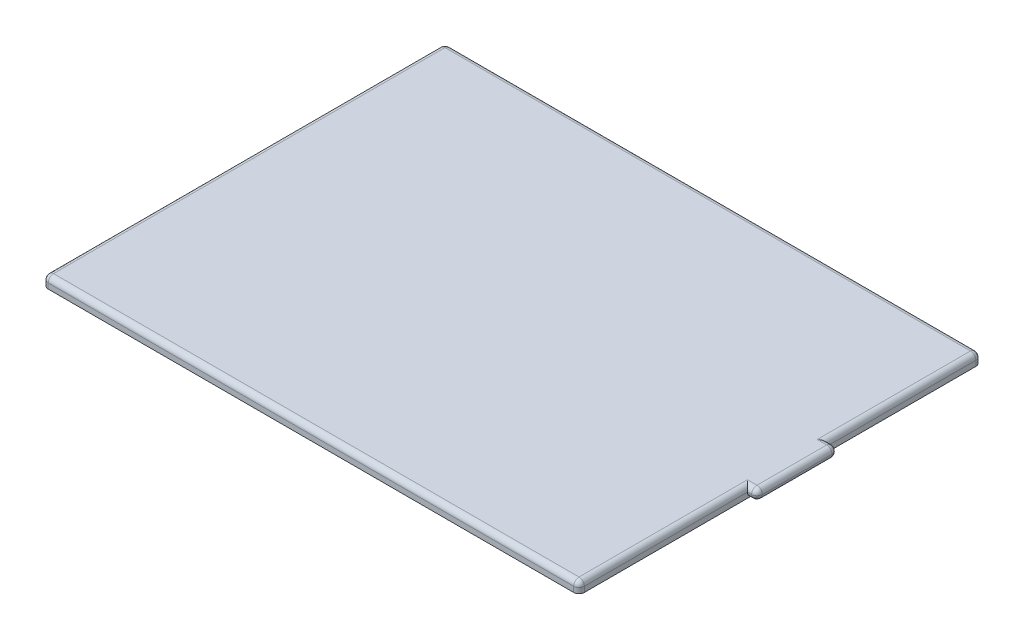
ISO-10303-21;
HEADER;
FILE_DESCRIPTION(('STEP AP214'),'2;1');
FILE_NAME('part.step','',(''),(''),'','','');
FILE_SCHEMA(('AUTOMOTIVE_DESIGN { 1 0 10303 214 1 1 1 1 }'));
ENDSEC;
DATA;
#1=APPLICATION_CONTEXT('core data for automotive mechanical design processes');
#2=APPLICATION_PROTOCOL_DEFINITION('international standard','automotive_design',2000,#1);
#3=PRODUCT_CONTEXT('',#1,'mechanical');
#4=PRODUCT('Part','Part','',(#3));
#5=PRODUCT_RELATED_PRODUCT_CATEGORY('part','',(#4));
#6=PRODUCT_DEFINITION_FORMATION('','',#4);
#7=PRODUCT_DEFINITION_CONTEXT('part definition',#1,'design');
#8=PRODUCT_DEFINITION('design','',#6,#7);
#9=PRODUCT_DEFINITION_SHAPE('','',#8);
#10=(LENGTH_UNIT() NAMED_UNIT(*) SI_UNIT(.MILLI.,.METRE.));
#11=(NAMED_UNIT(*) PLANE_ANGLE_UNIT() SI_UNIT($,.RADIAN.));
#12=(NAMED_UNIT(*) SI_UNIT($,.STERADIAN.) SOLID_ANGLE_UNIT());
#13=UNCERTAINTY_MEASURE_WITH_UNIT(LENGTH_MEASURE(1.E-05),#10,'distance_accuracy_value','');
#14=(GEOMETRIC_REPRESENTATION_CONTEXT(3) GLOBAL_UNCERTAINTY_ASSIGNED_CONTEXT((#13)) GLOBAL_UNIT_ASSIGNED_CONTEXT((#10,
#11,#12)) REPRESENTATION_CONTEXT('',''));
#15=CARTESIAN_POINT('',(0.,0.,0.));
#16=DIRECTION('',(0.,0.,1.));
#17=DIRECTION('',(1.,0.,0.));
#18=AXIS2_PLACEMENT_3D('',#15,#16,#17);
#19=CARTESIAN_POINT('',(-6.41025641025642,4.,-94.7115384615385));
#20=DIRECTION('',(-1.,0.,0.));
#21=DIRECTION('',(0.,0.,1.));
#22=AXIS2_PLACEMENT_3D('',#19,#20,#21);
#23=PLANE('',#22);
#24=DIRECTION('',(0.,0.,-1.));
#25=VECTOR('',#24,1.);
#26=CARTESIAN_POINT('',(-6.4102564102564,2.,53.2884615384615));
#27=LINE('',#26,#25);
#28=CARTESIAN_POINT('',(-6.41025641025642,2.,-92.7115384615385));
#29=VERTEX_POINT('',#28);
#30=CARTESIAN_POINT('',(-6.41025641025641,2.,-37.54913689604));
#31=VERTEX_POINT('',#30);
#32=EDGE_CURVE('E334',#29,#31,#27,.F.);
#33=ORIENTED_EDGE('',*,*,#32,.T.);
#34=CARTESIAN_POINT('',(-6.41025641025641,2.,-35.54913689604));
#35=DIRECTION('',(-1.,0.,0.));
#36=DIRECTION('',(0.,0.,1.));
#37=AXIS2_PLACEMENT_3D('',#34,#35,#36);
#38=CIRCLE('',#37,2.);
#39=CARTESIAN_POINT('',(-6.41025641025641,0.,-35.54913689604));
#40=VERTEX_POINT('',#39);
#41=EDGE_CURVE('E241',#31,#40,#38,.T.);
#42=ORIENTED_EDGE('',*,*,#41,.T.);
#43=DIRECTION('',(0.,0.,-1.));
#44=VECTOR('',#43,1.);
#45=CARTESIAN_POINT('',(-6.41025641025642,0.,-94.7115384615385));
#46=LINE('',#45,#44);
#47=CARTESIAN_POINT('',(-6.41025641025642,0.,-92.7115384615385));
#48=VERTEX_POINT('',#47);
#49=EDGE_CURVE('E291',#40,#48,#46,.T.);
#50=ORIENTED_EDGE('',*,*,#49,.T.);
#51=DIRECTION('',(0.,-1.,0.));
#52=VECTOR('',#51,1.);
#53=CARTESIAN_POINT('',(-6.41025641025642,4.,-92.7115384615385));
#54=LINE('',#53,#52);
#55=EDGE_CURVE('E336',#48,#29,#54,.F.);
#56=ORIENTED_EDGE('',*,*,#55,.T.);
#57=EDGE_LOOP('',(#33,#42,#50,#56));
#58=FACE_BOUND('',#57,.T.);
#59=ADVANCED_FACE('F35',(#58),#23,.F.);
#60=CARTESIAN_POINT('',(-8.41025641025641,2.,0.));
#61=DIRECTION('',(0.,0.,1.));
#62=DIRECTION('',(1.,0.,0.));
#63=AXIS2_PLACEMENT_3D('',#60,#61,#62);
#64=CYLINDRICAL_SURFACE('',#63,2.);
#65=DIRECTION('',(0.,0.,-1.));
#66=VECTOR('',#65,1.);
#67=CARTESIAN_POINT('',(-8.41025641025642,4.,-92.7115384615385));
#68=LINE('',#67,#66);
#69=CARTESIAN_POINT('',(-8.41025641025641,4.,-35.54913689604));
#70=VERTEX_POINT('',#69);
#71=CARTESIAN_POINT('',(-8.41025641025642,4.,-92.7115384615385));
#72=VERTEX_POINT('',#71);
#73=EDGE_CURVE('E360',#70,#72,#68,.T.);
#74=ORIENTED_EDGE('',*,*,#73,.F.);
#75=CARTESIAN_POINT('',(-8.41025641025641,2.,-35.54913689604));
#76=DIRECTION('',(-0.707106781186548,0.,-0.707106781186547));
#77=DIRECTION('',(-0.707106781186547,0.,0.707106781186548));
#78=AXIS2_PLACEMENT_3D('',#75,#76,#77);
#79=ELLIPSE('',#78,2.82842712474619,2.);
#80=EDGE_CURVE('E11',#70,#31,#79,.T.);
#81=ORIENTED_EDGE('',*,*,#80,.T.);
#82=ORIENTED_EDGE('',*,*,#32,.F.);
#83=CARTESIAN_POINT('',(-8.41025641025642,2.,-92.7115384615385));
#84=DIRECTION('',(0.,0.,1.));
#85=DIRECTION('',(1.,0.,0.));
#86=AXIS2_PLACEMENT_3D('',#83,#84,#85);
#87=CIRCLE('',#86,2.);
#88=EDGE_CURVE('E364',#29,#72,#87,.T.);
#89=ORIENTED_EDGE('',*,*,#88,.T.);
#90=EDGE_LOOP('',(#74,#81,#82,#89));
#91=FACE_BOUND('',#90,.T.);
#92=ADVANCED_FACE('F265',(#91),#64,.T.);
#93=CARTESIAN_POINT('',(-6.4102564102564,0.,53.2884615384615));
#94=VERTEX_POINT('',#93);
#95=CARTESIAN_POINT('',(-6.41025641025641,0.,-9.54913689603996));
#96=VERTEX_POINT('',#95);
#97=EDGE_CURVE('E286',#94,#96,#46,.T.);
#98=ORIENTED_EDGE('',*,*,#97,.T.);
#99=CARTESIAN_POINT('',(-6.41025641025641,2.,-9.54913689603996));
#100=DIRECTION('',(-1.,0.,0.));
#101=DIRECTION('',(0.,0.,1.));
#102=AXIS2_PLACEMENT_3D('',#99,#100,#101);
#103=CIRCLE('',#102,2.);
#104=CARTESIAN_POINT('',(-6.41025641025641,2.,-7.54913689603996));
#105=VERTEX_POINT('',#104);
#106=EDGE_CURVE('E85',#96,#105,#103,.T.);
#107=ORIENTED_EDGE('',*,*,#106,.T.);
#108=CARTESIAN_POINT('',(-6.4102564102564,2.,53.2884615384615));
#109=VERTEX_POINT('',#108);
#110=EDGE_CURVE('E249',#105,#109,#27,.F.);
#111=ORIENTED_EDGE('',*,*,#110,.T.);
#112=DIRECTION('',(0.,-1.,0.));
#113=VECTOR('',#112,1.);
#114=CARTESIAN_POINT('',(-6.4102564102564,4.,53.2884615384615));
#115=LINE('',#114,#113);
#116=EDGE_CURVE('E288',#109,#94,#115,.T.);
#117=ORIENTED_EDGE('',*,*,#116,.T.);
#118=EDGE_LOOP('',(#98,#107,#111,#117));
#119=FACE_BOUND('',#118,.T.);
#120=ADVANCED_FACE('F268',(#119),#23,.F.);
#121=CARTESIAN_POINT('',(-206.410256410256,4.,-94.7115384615385));
#122=DIRECTION('',(0.,0.,1.));
#123=DIRECTION('',(1.,0.,0.));
#124=AXIS2_PLACEMENT_3D('',#121,#122,#123);
#125=PLANE('',#124);
#126=DIRECTION('',(-1.,0.,0.));
#127=VECTOR('',#126,1.);
#128=CARTESIAN_POINT('',(-206.410256410256,0.,-94.7115384615385));
#129=LINE('',#128,#127);
#130=CARTESIAN_POINT('',(-8.41025641025642,0.,-94.7115384615385));
#131=VERTEX_POINT('',#130);
#132=CARTESIAN_POINT('',(-204.410256410256,0.,-94.7115384615385));
#133=VERTEX_POINT('',#132);
#134=EDGE_CURVE('E290',#131,#133,#129,.T.);
#135=ORIENTED_EDGE('',*,*,#134,.T.);
#136=DIRECTION('',(0.,-1.,0.));
#137=VECTOR('',#136,1.);
#138=CARTESIAN_POINT('',(-204.410256410256,4.,-94.7115384615385));
#139=LINE('',#138,#137);
#140=CARTESIAN_POINT('',(-204.410256410256,2.,-94.7115384615385));
#141=VERTEX_POINT('',#140);
#142=EDGE_CURVE('E374',#133,#141,#139,.F.);
#143=ORIENTED_EDGE('',*,*,#142,.T.);
#144=DIRECTION('',(-1.,0.,0.));
#145=VECTOR('',#144,1.);
#146=CARTESIAN_POINT('',(-6.41025641025642,2.,-94.7115384615385));
#147=LINE('',#146,#145);
#148=CARTESIAN_POINT('',(-8.41025641025642,2.,-94.7115384615385));
#149=VERTEX_POINT('',#148);
#150=EDGE_CURVE('E389',#141,#149,#147,.F.);
#151=ORIENTED_EDGE('',*,*,#150,.T.);
#152=DIRECTION('',(0.,-1.,0.));
#153=VECTOR('',#152,1.);
#154=CARTESIAN_POINT('',(-8.41025641025642,4.,-94.7115384615385));
#155=LINE('',#154,#153);
#156=EDGE_CURVE('E355',#149,#131,#155,.T.);
#157=ORIENTED_EDGE('',*,*,#156,.T.);
#158=EDGE_LOOP('',(#135,#143,#151,#157));
#159=FACE_BOUND('',#158,.T.);
#160=ADVANCED_FACE('F278',(#159),#125,.F.);
#161=CARTESIAN_POINT('',(-206.410256410256,4.,-94.7115384615385));
#162=DIRECTION('',(1.,0.,0.));
#163=DIRECTION('',(0.,0.,-1.));
#164=AXIS2_PLACEMENT_3D('',#161,#162,#163);
#165=PLANE('',#164);
#166=DIRECTION('',(0.,0.,1.));
#167=VECTOR('',#166,1.);
#168=CARTESIAN_POINT('',(-206.410256410256,2.,-94.7115384615385));
#169=LINE('',#168,#167);
#170=CARTESIAN_POINT('',(-206.410256410256,2.,53.2884615384615));
#171=VERTEX_POINT('',#170);
#172=CARTESIAN_POINT('',(-206.410256410256,2.,-92.7115384615385));
#173=VERTEX_POINT('',#172);
#174=EDGE_CURVE('E398',#171,#173,#169,.F.);
#175=ORIENTED_EDGE('',*,*,#174,.T.);
#176=DIRECTION('',(0.,-1.,0.));
#177=VECTOR('',#176,1.);
#178=CARTESIAN_POINT('',(-206.410256410256,4.,-92.7115384615385));
#179=LINE('',#178,#177);
#180=CARTESIAN_POINT('',(-206.410256410256,0.,-92.7115384615385));
#181=VERTEX_POINT('',#180);
#182=EDGE_CURVE('E361',#173,#181,#179,.T.);
#183=ORIENTED_EDGE('',*,*,#182,.T.);
#184=DIRECTION('',(0.,0.,1.));
#185=VECTOR('',#184,1.);
#186=CARTESIAN_POINT('',(-206.410256410256,0.,-94.7115384615385));
#187=LINE('',#186,#185);
#188=CARTESIAN_POINT('',(-206.410256410256,0.,53.2884615384615));
#189=VERTEX_POINT('',#188);
#190=EDGE_CURVE('E402',#181,#189,#187,.T.);
#191=ORIENTED_EDGE('',*,*,#190,.T.);
#192=DIRECTION('',(0.,-1.,0.));
#193=VECTOR('',#192,1.);
#194=CARTESIAN_POINT('',(-206.410256410256,4.,53.2884615384615));
#195=LINE('',#194,#193);
#196=EDGE_CURVE('E422',#189,#171,#195,.F.);
#197=ORIENTED_EDGE('',*,*,#196,.T.);
#198=EDGE_LOOP('',(#175,#183,#191,#197));
#199=FACE_BOUND('',#198,.T.);
#200=ADVANCED_FACE('F282',(#199),#165,.F.);
#201=CARTESIAN_POINT('',(-206.410256410256,4.,55.2884615384615));
#202=DIRECTION('',(0.,0.,-1.));
#203=DIRECTION('',(-1.,0.,0.));
#204=AXIS2_PLACEMENT_3D('',#201,#202,#203);
#205=PLANE('',#204);
#206=DIRECTION('',(1.,0.,0.));
#207=VECTOR('',#206,1.);
#208=CARTESIAN_POINT('',(-206.410256410256,0.,55.2884615384615));
#209=LINE('',#208,#207);
#210=CARTESIAN_POINT('',(-204.410256410256,0.,55.2884615384615));
#211=VERTEX_POINT('',#210);
#212=CARTESIAN_POINT('',(-8.41025641025639,0.,55.2884615384615));
#213=VERTEX_POINT('',#212);
#214=EDGE_CURVE('E393',#211,#213,#209,.T.);
#215=ORIENTED_EDGE('',*,*,#214,.T.);
#216=DIRECTION('',(0.,-1.,0.));
#217=VECTOR('',#216,1.);
#218=CARTESIAN_POINT('',(-8.41025641025639,4.,55.2884615384615));
#219=LINE('',#218,#217);
#220=CARTESIAN_POINT('',(-8.41025641025639,2.,55.2884615384615));
#221=VERTEX_POINT('',#220);
#222=EDGE_CURVE('E351',#213,#221,#219,.F.);
#223=ORIENTED_EDGE('',*,*,#222,.T.);
#224=DIRECTION('',(1.,0.,0.));
#225=VECTOR('',#224,1.);
#226=CARTESIAN_POINT('',(-204.410256410256,2.,55.2884615384615));
#227=LINE('',#226,#225);
#228=CARTESIAN_POINT('',(-204.410256410256,2.,55.2884615384615));
#229=VERTEX_POINT('',#228);
#230=EDGE_CURVE('E416',#221,#229,#227,.F.);
#231=ORIENTED_EDGE('',*,*,#230,.T.);
#232=DIRECTION('',(0.,-1.,0.));
#233=VECTOR('',#232,1.);
#234=CARTESIAN_POINT('',(-204.410256410256,4.,55.2884615384615));
#235=LINE('',#234,#233);
#236=EDGE_CURVE('E418',#229,#211,#235,.T.);
#237=ORIENTED_EDGE('',*,*,#236,.T.);
#238=EDGE_LOOP('',(#215,#223,#231,#237));
#239=FACE_BOUND('',#238,.T.);
#240=ADVANCED_FACE('F443',(#239),#205,.F.);
#241=CARTESIAN_POINT('',(0.,4.,0.));
#242=DIRECTION('',(0.,1.,0.));
#243=DIRECTION('',(0.,0.,1.));
#244=AXIS2_PLACEMENT_3D('',#241,#242,#243);
#245=PLANE('',#244);
#246=CARTESIAN_POINT('',(-8.4102564102564,4.,53.2884615384615));
#247=VERTEX_POINT('',#246);
#248=CARTESIAN_POINT('',(-8.41025641025641,4.,-9.54913689603996));
#249=VERTEX_POINT('',#248);
#250=EDGE_CURVE('E54',#247,#249,#68,.T.);
#251=ORIENTED_EDGE('',*,*,#250,.T.);
#252=DIRECTION('',(1.,0.,0.));
#253=VECTOR('',#252,1.);
#254=CARTESIAN_POINT('',(0.,4.,-9.54913689603996));
#255=LINE('',#254,#253);
#256=CARTESIAN_POINT('',(-4.86589045098342,4.,-9.54913689603996));
#257=VERTEX_POINT('',#256);
#258=EDGE_CURVE('E169',#249,#257,#255,.T.);
#259=ORIENTED_EDGE('',*,*,#258,.T.);
#260=DIRECTION('',(0.,0.,-1.));
#261=VECTOR('',#260,1.);
#262=CARTESIAN_POINT('',(-4.86589045098341,4.,0.));
#263=LINE('',#262,#261);
#264=CARTESIAN_POINT('',(-4.86589045098342,4.,-35.54913689604));
#265=VERTEX_POINT('',#264);
#266=EDGE_CURVE('E163',#257,#265,#263,.T.);
#267=ORIENTED_EDGE('',*,*,#266,.T.);
#268=DIRECTION('',(-1.,0.,0.));
#269=VECTOR('',#268,1.);
#270=CARTESIAN_POINT('',(0.,4.,-35.54913689604));
#271=LINE('',#270,#269);
#272=EDGE_CURVE('E166',#265,#70,#271,.T.);
#273=ORIENTED_EDGE('',*,*,#272,.T.);
#274=ORIENTED_EDGE('',*,*,#73,.T.);
#275=DIRECTION('',(-1.,0.,0.));
#276=VECTOR('',#275,1.);
#277=CARTESIAN_POINT('',(-206.410256410256,4.,-92.7115384615385));
#278=LINE('',#277,#276);
#279=CARTESIAN_POINT('',(-204.410256410256,4.,-92.7115384615385));
#280=VERTEX_POINT('',#279);
#281=EDGE_CURVE('E387',#72,#280,#278,.T.);
#282=ORIENTED_EDGE('',*,*,#281,.T.);
#283=DIRECTION('',(0.,0.,1.));
#284=VECTOR('',#283,1.);
#285=CARTESIAN_POINT('',(-204.410256410256,4.,55.2884615384615));
#286=LINE('',#285,#284);
#287=CARTESIAN_POINT('',(-204.410256410256,4.,53.2884615384615));
#288=VERTEX_POINT('',#287);
#289=EDGE_CURVE('E391',#280,#288,#286,.T.);
#290=ORIENTED_EDGE('',*,*,#289,.T.);
#291=DIRECTION('',(1.,0.,0.));
#292=VECTOR('',#291,1.);
#293=CARTESIAN_POINT('',(-6.4102564102564,4.,53.2884615384615));
#294=LINE('',#293,#292);
#295=EDGE_CURVE('E341',#288,#247,#294,.T.);
#296=ORIENTED_EDGE('',*,*,#295,.T.);
#297=EDGE_LOOP('',(#251,#259,#267,#273,#274,#282,#290,#296));
#298=FACE_BOUND('',#297,.T.);
#299=ADVANCED_FACE('F165',(#298),#245,.T.);
#300=CARTESIAN_POINT('',(0.,0.,0.));
#301=DIRECTION('',(0.,1.,0.));
#302=DIRECTION('',(0.,0.,1.));
#303=AXIS2_PLACEMENT_3D('',#300,#301,#302);
#304=PLANE('',#303);
#305=DIRECTION('',(1.,0.,0.));
#306=VECTOR('',#305,1.);
#307=CARTESIAN_POINT('',(-6.4102564102564,0.,-9.54913689603996));
#308=LINE('',#307,#306);
#309=CARTESIAN_POINT('',(-4.86589045098342,0.,-9.54913689603996));
#310=VERTEX_POINT('',#309);
#311=EDGE_CURVE('E235',#310,#96,#308,.F.);
#312=ORIENTED_EDGE('',*,*,#311,.T.);
#313=ORIENTED_EDGE('',*,*,#97,.F.);
#314=CARTESIAN_POINT('',(-8.4102564102564,0.,53.2884615384615));
#315=DIRECTION('',(0.,1.,0.));
#316=DIRECTION('',(0.,0.,1.));
#317=AXIS2_PLACEMENT_3D('',#314,#315,#316);
#318=CIRCLE('',#317,2.);
#319=EDGE_CURVE('E349',#94,#213,#318,.F.);
#320=ORIENTED_EDGE('',*,*,#319,.T.);
#321=ORIENTED_EDGE('',*,*,#214,.F.);
#322=CARTESIAN_POINT('',(-204.410256410256,0.,53.2884615384615));
#323=DIRECTION('',(0.,1.,0.));
#324=DIRECTION('',(0.,0.,1.));
#325=AXIS2_PLACEMENT_3D('',#322,#323,#324);
#326=CIRCLE('',#325,2.);
#327=EDGE_CURVE('E407',#211,#189,#326,.F.);
#328=ORIENTED_EDGE('',*,*,#327,.T.);
#329=ORIENTED_EDGE('',*,*,#190,.F.);
#330=CARTESIAN_POINT('',(-204.410256410256,0.,-92.7115384615385));
#331=DIRECTION('',(0.,1.,0.));
#332=DIRECTION('',(0.,0.,1.));
#333=AXIS2_PLACEMENT_3D('',#330,#331,#332);
#334=CIRCLE('',#333,2.);
#335=EDGE_CURVE('E372',#181,#133,#334,.F.);
#336=ORIENTED_EDGE('',*,*,#335,.T.);
#337=ORIENTED_EDGE('',*,*,#134,.F.);
#338=CARTESIAN_POINT('',(-8.41025641025642,0.,-92.7115384615385));
#339=DIRECTION('',(0.,1.,0.));
#340=DIRECTION('',(0.,0.,1.));
#341=AXIS2_PLACEMENT_3D('',#338,#339,#340);
#342=CIRCLE('',#341,2.);
#343=EDGE_CURVE('E347',#131,#48,#342,.F.);
#344=ORIENTED_EDGE('',*,*,#343,.T.);
#345=ORIENTED_EDGE('',*,*,#49,.F.);
#346=DIRECTION('',(-1.,0.,0.));
#347=VECTOR('',#346,1.);
#348=CARTESIAN_POINT('',(-2.86589045098342,0.,-35.54913689604));
#349=LINE('',#348,#347);
#350=CARTESIAN_POINT('',(-4.86589045098342,0.,-35.54913689604));
#351=VERTEX_POINT('',#350);
#352=EDGE_CURVE('E174',#40,#351,#349,.F.);
#353=ORIENTED_EDGE('',*,*,#352,.T.);
#354=DIRECTION('',(0.,0.,-1.));
#355=VECTOR('',#354,1.);
#356=CARTESIAN_POINT('',(-4.86589045098342,0.,-7.54913689603996));
#357=LINE('',#356,#355);
#358=EDGE_CURVE('E233',#351,#310,#357,.F.);
#359=ORIENTED_EDGE('',*,*,#358,.T.);
#360=EDGE_LOOP('',(#312,#313,#320,#321,#328,#329,#336,#337,#344,#345,#353,#359));
#361=FACE_BOUND('',#360,.T.);
#362=ADVANCED_FACE('F294',(#361),#304,.F.);
#363=CARTESIAN_POINT('',(0.,2.,-92.7115384615385));
#364=DIRECTION('',(1.,0.,0.));
#365=DIRECTION('',(0.,0.,-1.));
#366=AXIS2_PLACEMENT_3D('',#363,#364,#365);
#367=CYLINDRICAL_SURFACE('',#366,2.);
#368=ORIENTED_EDGE('',*,*,#150,.F.);
#369=CARTESIAN_POINT('',(-204.410256410256,2.,-92.7115384615385));
#370=DIRECTION('',(1.,0.,0.));
#371=DIRECTION('',(0.,0.,-1.));
#372=AXIS2_PLACEMENT_3D('',#369,#370,#371);
#373=CIRCLE('',#372,2.);
#374=EDGE_CURVE('E231',#141,#280,#373,.T.);
#375=ORIENTED_EDGE('',*,*,#374,.T.);
#376=ORIENTED_EDGE('',*,*,#281,.F.);
#377=CARTESIAN_POINT('',(-8.41025641025642,2.,-92.7115384615385));
#378=DIRECTION('',(1.,0.,0.));
#379=DIRECTION('',(0.,0.,-1.));
#380=AXIS2_PLACEMENT_3D('',#377,#378,#379);
#381=CIRCLE('',#380,2.);
#382=EDGE_CURVE('E357',#72,#149,#381,.F.);
#383=ORIENTED_EDGE('',*,*,#382,.T.);
#384=EDGE_LOOP('',(#368,#375,#376,#383));
#385=FACE_BOUND('',#384,.T.);
#386=ADVANCED_FACE('F386',(#385),#367,.T.);
#387=CARTESIAN_POINT('',(-204.410256410256,2.,0.));
#388=DIRECTION('',(0.,0.,-1.));
#389=DIRECTION('',(-1.,0.,0.));
#390=AXIS2_PLACEMENT_3D('',#387,#388,#389);
#391=CYLINDRICAL_SURFACE('',#390,2.);
#392=ORIENTED_EDGE('',*,*,#289,.F.);
#393=CARTESIAN_POINT('',(-204.410256410256,2.,-92.7115384615385));
#394=DIRECTION('',(0.,0.,-1.));
#395=DIRECTION('',(-1.,0.,0.));
#396=AXIS2_PLACEMENT_3D('',#393,#394,#395);
#397=CIRCLE('',#396,2.);
#398=EDGE_CURVE('E375',#280,#173,#397,.F.);
#399=ORIENTED_EDGE('',*,*,#398,.T.);
#400=ORIENTED_EDGE('',*,*,#174,.F.);
#401=CARTESIAN_POINT('',(-204.410256410256,2.,53.2884615384615));
#402=DIRECTION('',(0.,0.,-1.));
#403=DIRECTION('',(-1.,0.,0.));
#404=AXIS2_PLACEMENT_3D('',#401,#402,#403);
#405=CIRCLE('',#404,2.);
#406=EDGE_CURVE('E397',#171,#288,#405,.T.);
#407=ORIENTED_EDGE('',*,*,#406,.T.);
#408=EDGE_LOOP('',(#392,#399,#400,#407));
#409=FACE_BOUND('',#408,.T.);
#410=ADVANCED_FACE('F395',(#409),#391,.T.);
#411=CARTESIAN_POINT('',(0.,2.,53.2884615384615));
#412=DIRECTION('',(-1.,0.,0.));
#413=DIRECTION('',(0.,0.,1.));
#414=AXIS2_PLACEMENT_3D('',#411,#412,#413);
#415=CYLINDRICAL_SURFACE('',#414,2.);
#416=ORIENTED_EDGE('',*,*,#230,.F.);
#417=CARTESIAN_POINT('',(-8.4102564102564,2.,53.2884615384615));
#418=DIRECTION('',(-1.,0.,0.));
#419=DIRECTION('',(0.,0.,1.));
#420=AXIS2_PLACEMENT_3D('',#417,#418,#419);
#421=CIRCLE('',#420,2.);
#422=EDGE_CURVE('E353',#221,#247,#421,.T.);
#423=ORIENTED_EDGE('',*,*,#422,.T.);
#424=ORIENTED_EDGE('',*,*,#295,.F.);
#425=CARTESIAN_POINT('',(-204.410256410256,2.,53.2884615384615));
#426=DIRECTION('',(-1.,0.,0.));
#427=DIRECTION('',(0.,0.,1.));
#428=AXIS2_PLACEMENT_3D('',#425,#426,#427);
#429=CIRCLE('',#428,2.);
#430=EDGE_CURVE('E343',#229,#288,#429,.T.);
#431=ORIENTED_EDGE('',*,*,#430,.F.);
#432=EDGE_LOOP('',(#416,#423,#424,#431));
#433=FACE_BOUND('',#432,.T.);
#434=ADVANCED_FACE('F435',(#433),#415,.T.);
#435=CARTESIAN_POINT('',(-204.410256410256,2.,53.2884615384615));
#436=DIRECTION('',(0.,0.,-1.));
#437=DIRECTION('',(-1.,0.,0.));
#438=AXIS2_PLACEMENT_3D('',#435,#436,#437);
#439=SPHERICAL_SURFACE('',#438,2.);
#440=ORIENTED_EDGE('',*,*,#430,.T.);
#441=ORIENTED_EDGE('',*,*,#406,.F.);
#442=CARTESIAN_POINT('',(-204.410256410256,2.,53.2884615384615));
#443=DIRECTION('',(0.,-1.,0.));
#444=DIRECTION('',(0.,0.,-1.));
#445=AXIS2_PLACEMENT_3D('',#442,#443,#444);
#446=CIRCLE('',#445,2.);
#447=EDGE_CURVE('E369',#229,#171,#446,.T.);
#448=ORIENTED_EDGE('',*,*,#447,.F.);
#449=EDGE_LOOP('',(#440,#441,#448));
#450=FACE_BOUND('',#449,.T.);
#451=ADVANCED_FACE('F432',(#450),#439,.T.);
#452=CARTESIAN_POINT('',(-204.410256410256,4.,53.2884615384615));
#453=DIRECTION('',(0.,-1.,0.));
#454=DIRECTION('',(0.,0.,-1.));
#455=AXIS2_PLACEMENT_3D('',#452,#453,#454);
#456=CYLINDRICAL_SURFACE('',#455,2.);
#457=ORIENTED_EDGE('',*,*,#447,.T.);
#458=ORIENTED_EDGE('',*,*,#196,.F.);
#459=ORIENTED_EDGE('',*,*,#327,.F.);
#460=ORIENTED_EDGE('',*,*,#236,.F.);
#461=EDGE_LOOP('',(#457,#458,#459,#460));
#462=FACE_BOUND('',#461,.T.);
#463=ADVANCED_FACE('F444',(#462),#456,.T.);
#464=CARTESIAN_POINT('',(-8.41025641025642,4.,-92.7115384615385));
#465=DIRECTION('',(0.,-1.,0.));
#466=DIRECTION('',(0.,0.,-1.));
#467=AXIS2_PLACEMENT_3D('',#464,#465,#466);
#468=CYLINDRICAL_SURFACE('',#467,2.);
#469=ORIENTED_EDGE('',*,*,#343,.F.);
#470=ORIENTED_EDGE('',*,*,#156,.F.);
#471=CARTESIAN_POINT('',(-8.41025641025642,2.,-92.7115384615385));
#472=DIRECTION('',(0.,1.,0.));
#473=DIRECTION('',(0.,0.,1.));
#474=AXIS2_PLACEMENT_3D('',#471,#472,#473);
#475=CIRCLE('',#474,2.);
#476=EDGE_CURVE('E366',#29,#149,#475,.T.);
#477=ORIENTED_EDGE('',*,*,#476,.F.);
#478=ORIENTED_EDGE('',*,*,#55,.F.);
#479=EDGE_LOOP('',(#469,#470,#477,#478));
#480=FACE_BOUND('',#479,.T.);
#481=ADVANCED_FACE('F312',(#480),#468,.T.);
#482=CARTESIAN_POINT('',(-8.41025641025642,2.,-92.7115384615385));
#483=DIRECTION('',(-1.,0.,0.));
#484=DIRECTION('',(0.,0.,1.));
#485=AXIS2_PLACEMENT_3D('',#482,#483,#484);
#486=SPHERICAL_SURFACE('',#485,2.);
#487=ORIENTED_EDGE('',*,*,#476,.T.);
#488=ORIENTED_EDGE('',*,*,#382,.F.);
#489=ORIENTED_EDGE('',*,*,#88,.F.);
#490=EDGE_LOOP('',(#487,#488,#489));
#491=FACE_BOUND('',#490,.T.);
#492=ADVANCED_FACE('F451',(#491),#486,.T.);
#493=ORIENTED_EDGE('',*,*,#110,.F.);
#494=CARTESIAN_POINT('',(-8.41025641025641,2.,-9.54913689603996));
#495=DIRECTION('',(0.707106781186547,0.,-0.707106781186548));
#496=DIRECTION('',(0.707106781186548,0.,0.707106781186547));
#497=AXIS2_PLACEMENT_3D('',#494,#495,#496);
#498=ELLIPSE('',#497,2.82842712474619,2.);
#499=EDGE_CURVE('E45',#105,#249,#498,.F.);
#500=ORIENTED_EDGE('',*,*,#499,.T.);
#501=ORIENTED_EDGE('',*,*,#250,.F.);
#502=CARTESIAN_POINT('',(-8.4102564102564,2.,53.2884615384615));
#503=DIRECTION('',(0.,0.,1.));
#504=DIRECTION('',(1.,0.,0.));
#505=AXIS2_PLACEMENT_3D('',#502,#503,#504);
#506=CIRCLE('',#505,2.);
#507=EDGE_CURVE('E227',#109,#247,#506,.T.);
#508=ORIENTED_EDGE('',*,*,#507,.F.);
#509=EDGE_LOOP('',(#493,#500,#501,#508));
#510=FACE_BOUND('',#509,.T.);
#511=ADVANCED_FACE('F246',(#510),#64,.T.);
#512=CARTESIAN_POINT('',(-8.4102564102564,2.,53.2884615384615));
#513=DIRECTION('',(-1.,0.,0.));
#514=DIRECTION('',(0.,0.,1.));
#515=AXIS2_PLACEMENT_3D('',#512,#513,#514);
#516=SPHERICAL_SURFACE('',#515,2.);
#517=ORIENTED_EDGE('',*,*,#507,.T.);
#518=ORIENTED_EDGE('',*,*,#422,.F.);
#519=CARTESIAN_POINT('',(-8.4102564102564,2.,53.2884615384615));
#520=DIRECTION('',(0.,-1.,0.));
#521=DIRECTION('',(0.,0.,-1.));
#522=AXIS2_PLACEMENT_3D('',#519,#520,#521);
#523=CIRCLE('',#522,2.);
#524=EDGE_CURVE('E220',#109,#221,#523,.T.);
#525=ORIENTED_EDGE('',*,*,#524,.F.);
#526=EDGE_LOOP('',(#517,#518,#525));
#527=FACE_BOUND('',#526,.T.);
#528=ADVANCED_FACE('F439',(#527),#516,.T.);
#529=CARTESIAN_POINT('',(-8.4102564102564,4.,53.2884615384615));
#530=DIRECTION('',(0.,-1.,0.));
#531=DIRECTION('',(0.,0.,-1.));
#532=AXIS2_PLACEMENT_3D('',#529,#530,#531);
#533=CYLINDRICAL_SURFACE('',#532,2.);
#534=ORIENTED_EDGE('',*,*,#524,.T.);
#535=ORIENTED_EDGE('',*,*,#222,.F.);
#536=ORIENTED_EDGE('',*,*,#319,.F.);
#537=ORIENTED_EDGE('',*,*,#116,.F.);
#538=EDGE_LOOP('',(#534,#535,#536,#537));
#539=FACE_BOUND('',#538,.T.);
#540=ADVANCED_FACE('F308',(#539),#533,.T.);
#541=CARTESIAN_POINT('',(-204.410256410256,2.,-92.7115384615385));
#542=DIRECTION('',(0.,0.,1.));
#543=DIRECTION('',(1.,0.,0.));
#544=AXIS2_PLACEMENT_3D('',#541,#542,#543);
#545=SPHERICAL_SURFACE('',#544,2.);
#546=ORIENTED_EDGE('',*,*,#398,.F.);
#547=ORIENTED_EDGE('',*,*,#374,.F.);
#548=CARTESIAN_POINT('',(-204.410256410256,2.,-92.7115384615385));
#549=DIRECTION('',(0.,-1.,0.));
#550=DIRECTION('',(0.,0.,-1.));
#551=AXIS2_PLACEMENT_3D('',#548,#549,#550);
#552=CIRCLE('',#551,2.);
#553=EDGE_CURVE('E215',#173,#141,#552,.T.);
#554=ORIENTED_EDGE('',*,*,#553,.F.);
#555=EDGE_LOOP('',(#546,#547,#554));
#556=FACE_BOUND('',#555,.T.);
#557=ADVANCED_FACE('F303',(#556),#545,.T.);
#558=CARTESIAN_POINT('',(-204.410256410256,4.,-92.7115384615385));
#559=DIRECTION('',(0.,-1.,0.));
#560=DIRECTION('',(0.,0.,-1.));
#561=AXIS2_PLACEMENT_3D('',#558,#559,#560);
#562=CYLINDRICAL_SURFACE('',#561,2.);
#563=ORIENTED_EDGE('',*,*,#553,.T.);
#564=ORIENTED_EDGE('',*,*,#142,.F.);
#565=ORIENTED_EDGE('',*,*,#335,.F.);
#566=ORIENTED_EDGE('',*,*,#182,.F.);
#567=EDGE_LOOP('',(#563,#564,#565,#566));
#568=FACE_BOUND('',#567,.T.);
#569=ADVANCED_FACE('F298',(#568),#562,.T.);
#570=CARTESIAN_POINT('',(-10.8658904509834,2.,-9.54913689603996));
#571=DIRECTION('',(-1.,0.,0.));
#572=DIRECTION('',(0.,0.,1.));
#573=AXIS2_PLACEMENT_3D('',#570,#571,#572);
#574=CYLINDRICAL_SURFACE('',#573,2.);
#575=CARTESIAN_POINT('',(-4.86589045098342,2.,-9.54913689603996));
#576=DIRECTION('',(1.,0.,0.));
#577=DIRECTION('',(0.,0.,-1.));
#578=AXIS2_PLACEMENT_3D('',#575,#576,#577);
#579=CIRCLE('',#578,2.);
#580=CARTESIAN_POINT('',(-4.86589045098342,2.,-7.54913689603996));
#581=VERTEX_POINT('',#580);
#582=EDGE_CURVE('E213',#581,#310,#579,.T.);
#583=ORIENTED_EDGE('',*,*,#582,.F.);
#584=DIRECTION('',(1.,0.,0.));
#585=VECTOR('',#584,1.);
#586=CARTESIAN_POINT('',(-2.86589045098341,2.,-7.54913689603996));
#587=LINE('',#586,#585);
#588=EDGE_CURVE('E39',#105,#581,#587,.T.);
#589=ORIENTED_EDGE('',*,*,#588,.F.);
#590=ORIENTED_EDGE('',*,*,#106,.F.);
#591=ORIENTED_EDGE('',*,*,#311,.F.);
#592=EDGE_LOOP('',(#583,#589,#590,#591));
#593=FACE_BOUND('',#592,.T.);
#594=ADVANCED_FACE('F37',(#593),#574,.T.);
#595=CARTESIAN_POINT('',(0.,2.,-9.54913689603996));
#596=DIRECTION('',(1.,0.,0.));
#597=DIRECTION('',(0.,0.,-1.));
#598=AXIS2_PLACEMENT_3D('',#595,#596,#597);
#599=CYLINDRICAL_SURFACE('',#598,2.);
#600=ORIENTED_EDGE('',*,*,#499,.F.);
#601=ORIENTED_EDGE('',*,*,#588,.T.);
#602=CARTESIAN_POINT('',(-4.86589045098342,2.,-9.54913689603996));
#603=DIRECTION('',(1.,0.,0.));
#604=DIRECTION('',(0.,0.,-1.));
#605=AXIS2_PLACEMENT_3D('',#602,#603,#604);
#606=CIRCLE('',#605,2.);
#607=EDGE_CURVE('E211',#257,#581,#606,.T.);
#608=ORIENTED_EDGE('',*,*,#607,.F.);
#609=ORIENTED_EDGE('',*,*,#258,.F.);
#610=EDGE_LOOP('',(#600,#601,#608,#609));
#611=FACE_BOUND('',#610,.T.);
#612=ADVANCED_FACE('F250',(#611),#599,.T.);
#613=CARTESIAN_POINT('',(-4.86589045098342,2.,-9.54913689603996));
#614=DIRECTION('',(0.,0.,1.));
#615=DIRECTION('',(1.,0.,0.));
#616=AXIS2_PLACEMENT_3D('',#613,#614,#615);
#617=SPHERICAL_SURFACE('',#616,2.);
#618=CARTESIAN_POINT('',(-4.86589045098342,2.,-9.54913689603996));
#619=DIRECTION('',(0.,-1.,0.));
#620=DIRECTION('',(0.,0.,-1.));
#621=AXIS2_PLACEMENT_3D('',#618,#619,#620);
#622=CIRCLE('',#621,2.);
#623=CARTESIAN_POINT('',(-2.86589045098342,2.,-9.54913689603996));
#624=VERTEX_POINT('',#623);
#625=EDGE_CURVE('E72',#624,#581,#622,.T.);
#626=ORIENTED_EDGE('',*,*,#625,.T.);
#627=ORIENTED_EDGE('',*,*,#582,.T.);
#628=CARTESIAN_POINT('',(-4.86589045098342,2.,-9.54913689603996));
#629=DIRECTION('',(0.,0.,1.));
#630=DIRECTION('',(1.,0.,0.));
#631=AXIS2_PLACEMENT_3D('',#628,#629,#630);
#632=CIRCLE('',#631,2.);
#633=EDGE_CURVE('E208',#624,#310,#632,.F.);
#634=ORIENTED_EDGE('',*,*,#633,.F.);
#635=EDGE_LOOP('',(#626,#627,#634));
#636=FACE_BOUND('',#635,.T.);
#637=ADVANCED_FACE('F254',(#636),#617,.T.);
#638=CARTESIAN_POINT('',(-4.86589045098342,2.,-9.54913689603996));
#639=DIRECTION('',(0.,0.,1.));
#640=DIRECTION('',(1.,0.,0.));
#641=AXIS2_PLACEMENT_3D('',#638,#639,#640);
#642=SPHERICAL_SURFACE('',#641,2.);
#643=ORIENTED_EDGE('',*,*,#607,.T.);
#644=ORIENTED_EDGE('',*,*,#625,.F.);
#645=CARTESIAN_POINT('',(-4.86589045098342,2.,-9.54913689603996));
#646=DIRECTION('',(0.,0.,1.));
#647=DIRECTION('',(1.,0.,0.));
#648=AXIS2_PLACEMENT_3D('',#645,#646,#647);
#649=CIRCLE('',#648,2.);
#650=EDGE_CURVE('E205',#257,#624,#649,.F.);
#651=ORIENTED_EDGE('',*,*,#650,.F.);
#652=EDGE_LOOP('',(#643,#644,#651));
#653=FACE_BOUND('',#652,.T.);
#654=ADVANCED_FACE('F251',(#653),#642,.T.);
#655=CARTESIAN_POINT('',(-10.8658904509834,2.,-35.54913689604));
#656=DIRECTION('',(1.,0.,0.));
#657=DIRECTION('',(0.,0.,-1.));
#658=AXIS2_PLACEMENT_3D('',#655,#656,#657);
#659=CYLINDRICAL_SURFACE('',#658,2.);
#660=ORIENTED_EDGE('',*,*,#352,.F.);
#661=ORIENTED_EDGE('',*,*,#41,.F.);
#662=DIRECTION('',(-1.,0.,0.));
#663=VECTOR('',#662,1.);
#664=CARTESIAN_POINT('',(-6.4102564102564,2.,-37.54913689604));
#665=LINE('',#664,#663);
#666=CARTESIAN_POINT('',(-4.86589045098342,2.,-37.54913689604));
#667=VERTEX_POINT('',#666);
#668=EDGE_CURVE('E203',#667,#31,#665,.T.);
#669=ORIENTED_EDGE('',*,*,#668,.F.);
#670=CARTESIAN_POINT('',(-4.86589045098342,2.,-35.54913689604));
#671=DIRECTION('',(1.,0.,0.));
#672=DIRECTION('',(0.,0.,-1.));
#673=AXIS2_PLACEMENT_3D('',#670,#671,#672);
#674=CIRCLE('',#673,2.);
#675=EDGE_CURVE('E200',#351,#667,#674,.T.);
#676=ORIENTED_EDGE('',*,*,#675,.F.);
#677=EDGE_LOOP('',(#660,#661,#669,#676));
#678=FACE_BOUND('',#677,.T.);
#679=ADVANCED_FACE('F253',(#678),#659,.T.);
#680=CARTESIAN_POINT('',(-4.86589045098342,2.,-37.54913689604));
#681=DIRECTION('',(0.,0.,1.));
#682=DIRECTION('',(1.,0.,0.));
#683=AXIS2_PLACEMENT_3D('',#680,#681,#682);
#684=CYLINDRICAL_SURFACE('',#683,2.);
#685=DIRECTION('',(0.,0.,-1.));
#686=VECTOR('',#685,1.);
#687=CARTESIAN_POINT('',(-2.86589045098342,2.,-37.54913689604));
#688=LINE('',#687,#686);
#689=CARTESIAN_POINT('',(-2.86589045098342,2.,-35.54913689604));
#690=VERTEX_POINT('',#689);
#691=EDGE_CURVE('E188',#624,#690,#688,.T.);
#692=ORIENTED_EDGE('',*,*,#691,.F.);
#693=ORIENTED_EDGE('',*,*,#633,.T.);
#694=ORIENTED_EDGE('',*,*,#358,.F.);
#695=CARTESIAN_POINT('',(-4.86589045098342,2.,-35.54913689604));
#696=DIRECTION('',(0.,0.,-1.));
#697=DIRECTION('',(-1.,0.,0.));
#698=AXIS2_PLACEMENT_3D('',#695,#696,#697);
#699=CIRCLE('',#698,2.);
#700=EDGE_CURVE('E192',#690,#351,#699,.T.);
#701=ORIENTED_EDGE('',*,*,#700,.F.);
#702=EDGE_LOOP('',(#692,#693,#694,#701));
#703=FACE_BOUND('',#702,.T.);
#704=ADVANCED_FACE('F260',(#703),#684,.T.);
#705=CARTESIAN_POINT('',(-4.86589045098341,2.,0.));
#706=DIRECTION('',(0.,0.,-1.));
#707=DIRECTION('',(-1.,0.,0.));
#708=AXIS2_PLACEMENT_3D('',#705,#706,#707);
#709=CYLINDRICAL_SURFACE('',#708,2.);
#710=ORIENTED_EDGE('',*,*,#650,.T.);
#711=ORIENTED_EDGE('',*,*,#691,.T.);
#712=CARTESIAN_POINT('',(-4.86589045098342,2.,-35.54913689604));
#713=DIRECTION('',(0.,0.,-1.));
#714=DIRECTION('',(-1.,0.,0.));
#715=AXIS2_PLACEMENT_3D('',#712,#713,#714);
#716=CIRCLE('',#715,2.);
#717=EDGE_CURVE('E185',#265,#690,#716,.T.);
#718=ORIENTED_EDGE('',*,*,#717,.F.);
#719=ORIENTED_EDGE('',*,*,#266,.F.);
#720=EDGE_LOOP('',(#710,#711,#718,#719));
#721=FACE_BOUND('',#720,.T.);
#722=ADVANCED_FACE('F186',(#721),#709,.T.);
#723=CARTESIAN_POINT('',(0.,2.,-35.54913689604));
#724=DIRECTION('',(-1.,0.,0.));
#725=DIRECTION('',(0.,0.,1.));
#726=AXIS2_PLACEMENT_3D('',#723,#724,#725);
#727=CYLINDRICAL_SURFACE('',#726,2.);
#728=ORIENTED_EDGE('',*,*,#80,.F.);
#729=ORIENTED_EDGE('',*,*,#272,.F.);
#730=CARTESIAN_POINT('',(-4.86589045098342,2.,-35.54913689604));
#731=DIRECTION('',(1.,0.,0.));
#732=DIRECTION('',(0.,0.,-1.));
#733=AXIS2_PLACEMENT_3D('',#730,#731,#732);
#734=CIRCLE('',#733,2.);
#735=EDGE_CURVE('E181',#667,#265,#734,.T.);
#736=ORIENTED_EDGE('',*,*,#735,.F.);
#737=ORIENTED_EDGE('',*,*,#668,.T.);
#738=EDGE_LOOP('',(#728,#729,#736,#737));
#739=FACE_BOUND('',#738,.T.);
#740=ADVANCED_FACE('F178',(#739),#727,.T.);
#741=CARTESIAN_POINT('',(-4.86589045098342,2.,-35.54913689604));
#742=DIRECTION('',(0.,0.,1.));
#743=DIRECTION('',(1.,0.,0.));
#744=AXIS2_PLACEMENT_3D('',#741,#742,#743);
#745=SPHERICAL_SURFACE('',#744,2.);
#746=ORIENTED_EDGE('',*,*,#700,.T.);
#747=ORIENTED_EDGE('',*,*,#675,.T.);
#748=CARTESIAN_POINT('',(-4.86589045098342,2.,-35.54913689604));
#749=DIRECTION('',(0.,-1.,0.));
#750=DIRECTION('',(0.,0.,-1.));
#751=AXIS2_PLACEMENT_3D('',#748,#749,#750);
#752=CIRCLE('',#751,2.);
#753=EDGE_CURVE('E195',#690,#667,#752,.F.);
#754=ORIENTED_EDGE('',*,*,#753,.F.);
#755=EDGE_LOOP('',(#746,#747,#754));
#756=FACE_BOUND('',#755,.T.);
#757=ADVANCED_FACE('F317',(#756),#745,.T.);
#758=CARTESIAN_POINT('',(-4.86589045098342,2.,-35.54913689604));
#759=DIRECTION('',(0.,0.,1.));
#760=DIRECTION('',(1.,0.,0.));
#761=AXIS2_PLACEMENT_3D('',#758,#759,#760);
#762=SPHERICAL_SURFACE('',#761,2.);
#763=ORIENTED_EDGE('',*,*,#735,.T.);
#764=ORIENTED_EDGE('',*,*,#717,.T.);
#765=ORIENTED_EDGE('',*,*,#753,.T.);
#766=EDGE_LOOP('',(#763,#764,#765));
#767=FACE_BOUND('',#766,.T.);
#768=ADVANCED_FACE('F194',(#767),#762,.T.);
#769=CLOSED_SHELL('',(#59,#92,#120,#160,#200,#240,#299,#362,#386,#410,#434,#451,#463,#481,#492,
#511,#528,#540,#557,#569,#594,#612,#637,#654,#679,#704,#722,#740,#757,#768));
#770=MANIFOLD_SOLID_BREP('B2',#769);
#771=ADVANCED_BREP_SHAPE_REPRESENTATION('',(#18,#770),#14);
#772=SHAPE_DEFINITION_REPRESENTATION(#9,#771);
ENDSEC;
END-ISO-10303-21;
